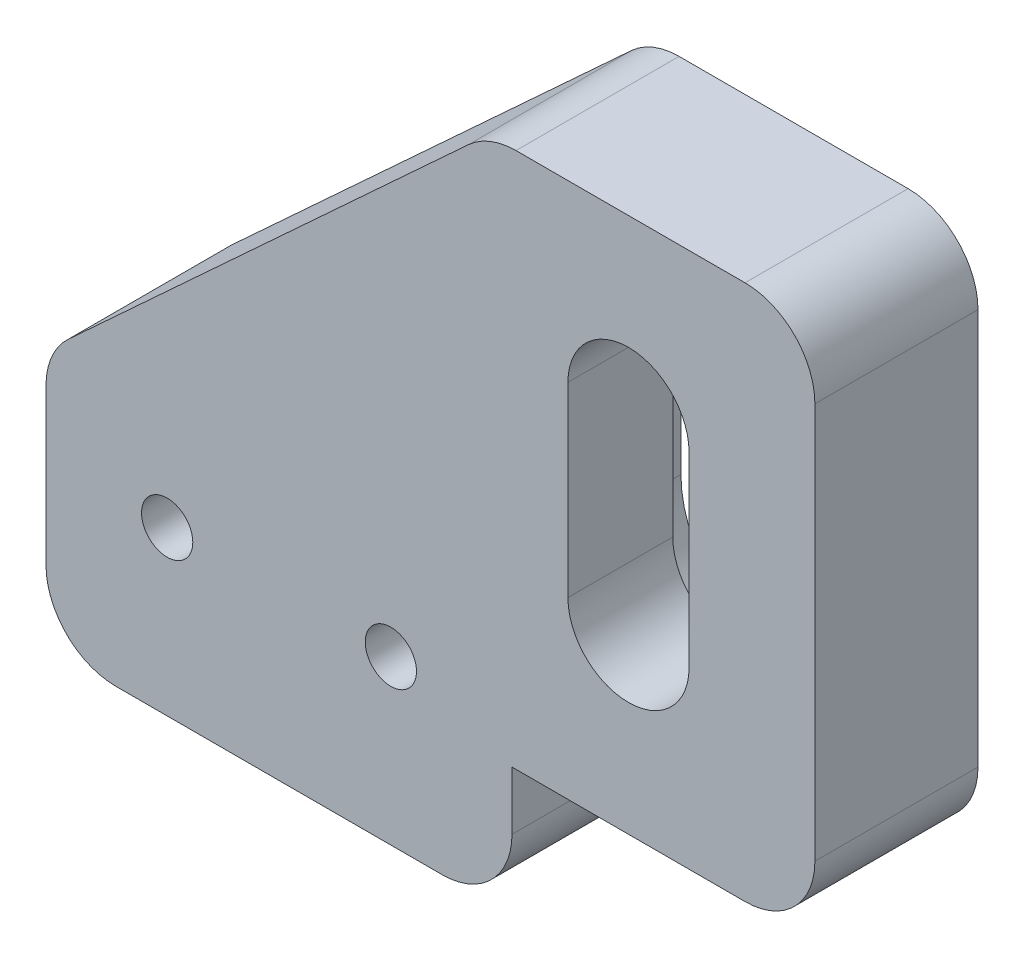
ISO-10303-21;
HEADER;
FILE_DESCRIPTION(('STEP AP214'),'2;1');
FILE_NAME('part.step','',(''),(''),'','','');
FILE_SCHEMA(('AUTOMOTIVE_DESIGN { 1 0 10303 214 1 1 1 1 }'));
ENDSEC;
DATA;
#1=APPLICATION_CONTEXT('core data for automotive mechanical design processes');
#2=APPLICATION_PROTOCOL_DEFINITION('international standard','automotive_design',2000,#1);
#3=PRODUCT_CONTEXT('',#1,'mechanical');
#4=PRODUCT('Part','Part','',(#3));
#5=PRODUCT_RELATED_PRODUCT_CATEGORY('part','',(#4));
#6=PRODUCT_DEFINITION_FORMATION('','',#4);
#7=PRODUCT_DEFINITION_CONTEXT('part definition',#1,'design');
#8=PRODUCT_DEFINITION('design','',#6,#7);
#9=PRODUCT_DEFINITION_SHAPE('','',#8);
#10=(LENGTH_UNIT() NAMED_UNIT(*) SI_UNIT(.MILLI.,.METRE.));
#11=(NAMED_UNIT(*) PLANE_ANGLE_UNIT() SI_UNIT($,.RADIAN.));
#12=(NAMED_UNIT(*) SI_UNIT($,.STERADIAN.) SOLID_ANGLE_UNIT());
#13=UNCERTAINTY_MEASURE_WITH_UNIT(LENGTH_MEASURE(1.E-05),#10,'distance_accuracy_value','');
#14=(GEOMETRIC_REPRESENTATION_CONTEXT(3) GLOBAL_UNCERTAINTY_ASSIGNED_CONTEXT((#13)) GLOBAL_UNIT_ASSIGNED_CONTEXT((#10,
#11,#12)) REPRESENTATION_CONTEXT('',''));
#15=CARTESIAN_POINT('',(0.,0.,0.));
#16=DIRECTION('',(0.,0.,1.));
#17=DIRECTION('',(1.,0.,0.));
#18=AXIS2_PLACEMENT_3D('',#15,#16,#17);
#19=CARTESIAN_POINT('',(25.,21.,7.));
#20=DIRECTION('',(0.,0.,-1.));
#21=DIRECTION('',(-1.,0.,0.));
#22=AXIS2_PLACEMENT_3D('',#19,#20,#21);
#23=CYLINDRICAL_SURFACE('',#22,2.6);
#24=DIRECTION('',(0.,0.,-1.));
#25=VECTOR('',#24,1.);
#26=CARTESIAN_POINT('',(22.4,21.,7.));
#27=LINE('',#26,#25);
#28=CARTESIAN_POINT('',(22.4,21.,7.));
#29=VERTEX_POINT('',#28);
#30=CARTESIAN_POINT('',(22.4,21.,2.5));
#31=VERTEX_POINT('',#30);
#32=EDGE_CURVE('E250',#29,#31,#27,.T.);
#33=ORIENTED_EDGE('',*,*,#32,.T.);
#34=CARTESIAN_POINT('',(25.,21.,2.5));
#35=DIRECTION('',(0.,0.,-1.));
#36=DIRECTION('',(-1.,0.,0.));
#37=AXIS2_PLACEMENT_3D('',#34,#35,#36);
#38=CIRCLE('',#37,2.6);
#39=CARTESIAN_POINT('',(27.6,21.,2.5));
#40=VERTEX_POINT('',#39);
#41=EDGE_CURVE('E217',#31,#40,#38,.T.);
#42=ORIENTED_EDGE('',*,*,#41,.T.);
#43=DIRECTION('',(0.,0.,-1.));
#44=VECTOR('',#43,1.);
#45=CARTESIAN_POINT('',(27.6,21.,7.));
#46=LINE('',#45,#44);
#47=CARTESIAN_POINT('',(27.6,21.,7.));
#48=VERTEX_POINT('',#47);
#49=EDGE_CURVE('E241',#48,#40,#46,.T.);
#50=ORIENTED_EDGE('',*,*,#49,.F.);
#51=CARTESIAN_POINT('',(25.,21.,7.));
#52=DIRECTION('',(0.,0.,1.));
#53=DIRECTION('',(1.,0.,0.));
#54=AXIS2_PLACEMENT_3D('',#51,#52,#53);
#55=CIRCLE('',#54,2.6);
#56=EDGE_CURVE('E230',#48,#29,#55,.T.);
#57=ORIENTED_EDGE('',*,*,#56,.T.);
#58=EDGE_LOOP('',(#33,#42,#50,#57));
#59=FACE_BOUND('',#58,.T.);
#60=ADVANCED_FACE('F33',(#59),#23,.F.);
#61=CARTESIAN_POINT('',(22.4,21.,7.));
#62=DIRECTION('',(1.,0.,0.));
#63=DIRECTION('',(0.,0.,-1.));
#64=AXIS2_PLACEMENT_3D('',#61,#62,#63);
#65=PLANE('',#64);
#66=DIRECTION('',(0.,0.,-1.));
#67=VECTOR('',#66,1.);
#68=CARTESIAN_POINT('',(22.4,13.,7.));
#69=LINE('',#68,#67);
#70=CARTESIAN_POINT('',(22.4,13.,7.));
#71=VERTEX_POINT('',#70);
#72=CARTESIAN_POINT('',(22.4,13.,2.5));
#73=VERTEX_POINT('',#72);
#74=EDGE_CURVE('E247',#71,#73,#69,.T.);
#75=ORIENTED_EDGE('',*,*,#74,.T.);
#76=DIRECTION('',(0.,1.,0.));
#77=VECTOR('',#76,1.);
#78=CARTESIAN_POINT('',(22.4,21.,2.5));
#79=LINE('',#78,#77);
#80=EDGE_CURVE('E214',#73,#31,#79,.T.);
#81=ORIENTED_EDGE('',*,*,#80,.T.);
#82=ORIENTED_EDGE('',*,*,#32,.F.);
#83=DIRECTION('',(0.,-1.,0.));
#84=VECTOR('',#83,1.);
#85=CARTESIAN_POINT('',(22.4,21.,7.));
#86=LINE('',#85,#84);
#87=EDGE_CURVE('E234',#29,#71,#86,.T.);
#88=ORIENTED_EDGE('',*,*,#87,.T.);
#89=EDGE_LOOP('',(#75,#81,#82,#88));
#90=FACE_BOUND('',#89,.T.);
#91=ADVANCED_FACE('F420',(#90),#65,.T.);
#92=CARTESIAN_POINT('',(25.,13.,7.));
#93=DIRECTION('',(0.,0.,-1.));
#94=DIRECTION('',(-1.,0.,0.));
#95=AXIS2_PLACEMENT_3D('',#92,#93,#94);
#96=CYLINDRICAL_SURFACE('',#95,2.6);
#97=DIRECTION('',(0.,0.,-1.));
#98=VECTOR('',#97,1.);
#99=CARTESIAN_POINT('',(27.6,13.,7.));
#100=LINE('',#99,#98);
#101=CARTESIAN_POINT('',(27.6,13.,7.));
#102=VERTEX_POINT('',#101);
#103=CARTESIAN_POINT('',(27.6,13.,2.5));
#104=VERTEX_POINT('',#103);
#105=EDGE_CURVE('E244',#102,#104,#100,.T.);
#106=ORIENTED_EDGE('',*,*,#105,.T.);
#107=CARTESIAN_POINT('',(25.,13.,2.5));
#108=DIRECTION('',(0.,0.,-1.));
#109=DIRECTION('',(-1.,0.,0.));
#110=AXIS2_PLACEMENT_3D('',#107,#108,#109);
#111=CIRCLE('',#110,2.6);
#112=EDGE_CURVE('E56',#104,#73,#111,.T.);
#113=ORIENTED_EDGE('',*,*,#112,.T.);
#114=ORIENTED_EDGE('',*,*,#74,.F.);
#115=CARTESIAN_POINT('',(25.,13.,7.));
#116=DIRECTION('',(0.,0.,1.));
#117=DIRECTION('',(1.,0.,0.));
#118=AXIS2_PLACEMENT_3D('',#115,#116,#117);
#119=CIRCLE('',#118,2.6);
#120=EDGE_CURVE('E236',#71,#102,#119,.T.);
#121=ORIENTED_EDGE('',*,*,#120,.T.);
#122=EDGE_LOOP('',(#106,#113,#114,#121));
#123=FACE_BOUND('',#122,.T.);
#124=ADVANCED_FACE('F426',(#123),#96,.F.);
#125=CARTESIAN_POINT('',(27.6,21.,7.));
#126=DIRECTION('',(-1.,0.,0.));
#127=DIRECTION('',(0.,0.,1.));
#128=AXIS2_PLACEMENT_3D('',#125,#126,#127);
#129=PLANE('',#128);
#130=ORIENTED_EDGE('',*,*,#49,.T.);
#131=DIRECTION('',(0.,-1.,0.));
#132=VECTOR('',#131,1.);
#133=CARTESIAN_POINT('',(27.6,21.,2.5));
#134=LINE('',#133,#132);
#135=EDGE_CURVE('E11',#40,#104,#134,.T.);
#136=ORIENTED_EDGE('',*,*,#135,.T.);
#137=ORIENTED_EDGE('',*,*,#105,.F.);
#138=DIRECTION('',(0.,1.,0.));
#139=VECTOR('',#138,1.);
#140=CARTESIAN_POINT('',(27.6,21.,7.));
#141=LINE('',#140,#139);
#142=EDGE_CURVE('E239',#102,#48,#141,.T.);
#143=ORIENTED_EDGE('',*,*,#142,.T.);
#144=EDGE_LOOP('',(#130,#136,#137,#143));
#145=FACE_BOUND('',#144,.T.);
#146=ADVANCED_FACE('F433',(#145),#129,.T.);
#147=CARTESIAN_POINT('',(30.,8.5,7.));
#148=DIRECTION('',(0.,0.,1.));
#149=DIRECTION('',(1.,0.,0.));
#150=AXIS2_PLACEMENT_3D('',#147,#148,#149);
#151=PLANE('',#150);
#152=CARTESIAN_POINT('',(5.2,7.,7.));
#153=DIRECTION('',(0.,0.,1.));
#154=DIRECTION('',(1.,0.,0.));
#155=AXIS2_PLACEMENT_3D('',#152,#153,#154);
#156=CIRCLE('',#155,1.1);
#157=CARTESIAN_POINT('',(6.3,7.,7.));
#158=VERTEX_POINT('',#157);
#159=EDGE_CURVE('E227',#158,#158,#156,.T.);
#160=ORIENTED_EDGE('',*,*,#159,.F.);
#161=EDGE_LOOP('',(#160));
#162=FACE_BOUND('',#161,.T.);
#163=CARTESIAN_POINT('',(30.,8.5,7.));
#164=DIRECTION('',(0.,0.,1.));
#165=DIRECTION('',(1.,0.,0.));
#166=AXIS2_PLACEMENT_3D('',#163,#164,#165);
#167=CIRCLE('',#166,3.);
#168=CARTESIAN_POINT('',(30.,5.5,7.));
#169=VERTEX_POINT('',#168);
#170=CARTESIAN_POINT('',(33.,8.5,7.));
#171=VERTEX_POINT('',#170);
#172=EDGE_CURVE('E254',#169,#171,#167,.T.);
#173=ORIENTED_EDGE('',*,*,#172,.T.);
#174=DIRECTION('',(0.,1.,0.));
#175=VECTOR('',#174,1.);
#176=CARTESIAN_POINT('',(33.,8.5,7.));
#177=LINE('',#176,#175);
#178=CARTESIAN_POINT('',(33.,25.5,7.));
#179=VERTEX_POINT('',#178);
#180=EDGE_CURVE('E257',#171,#179,#177,.T.);
#181=ORIENTED_EDGE('',*,*,#180,.T.);
#182=CARTESIAN_POINT('',(30.,25.5,7.));
#183=DIRECTION('',(0.,0.,1.));
#184=DIRECTION('',(1.,0.,0.));
#185=AXIS2_PLACEMENT_3D('',#182,#183,#184);
#186=CIRCLE('',#185,3.);
#187=CARTESIAN_POINT('',(30.,28.5,7.));
#188=VERTEX_POINT('',#187);
#189=EDGE_CURVE('E260',#179,#188,#186,.T.);
#190=ORIENTED_EDGE('',*,*,#189,.T.);
#191=DIRECTION('',(-1.,0.,0.));
#192=VECTOR('',#191,1.);
#193=CARTESIAN_POINT('',(20.1710598924878,28.5,7.));
#194=LINE('',#193,#192);
#195=CARTESIAN_POINT('',(20.1710598924878,28.5,7.));
#196=VERTEX_POINT('',#195);
#197=EDGE_CURVE('E262',#188,#196,#194,.T.);
#198=ORIENTED_EDGE('',*,*,#197,.T.);
#199=CARTESIAN_POINT('',(20.1710598924878,25.5,7.));
#200=DIRECTION('',(0.,0.,1.));
#201=DIRECTION('',(1.,0.,0.));
#202=AXIS2_PLACEMENT_3D('',#199,#200,#201);
#203=CIRCLE('',#202,3.);
#204=CARTESIAN_POINT('',(18.1386326282324,27.7066353154773,7.));
#205=VERTEX_POINT('',#204);
#206=EDGE_CURVE('E264',#196,#205,#203,.T.);
#207=ORIENTED_EDGE('',*,*,#206,.T.);
#208=DIRECTION('',(-0.735545105159087,-0.67747575475179,0.));
#209=VECTOR('',#208,1.);
#210=CARTESIAN_POINT('',(18.1386326282324,27.7066353154773,7.));
#211=LINE('',#210,#209);
#212=CARTESIAN_POINT('',(0.967572735744639,11.8911854145016,7.));
#213=VERTEX_POINT('',#212);
#214=EDGE_CURVE('E266',#205,#213,#211,.T.);
#215=ORIENTED_EDGE('',*,*,#214,.T.);
#216=CARTESIAN_POINT('',(3.,9.68455009902437,7.));
#217=DIRECTION('',(0.,0.,1.));
#218=DIRECTION('',(1.,0.,0.));
#219=AXIS2_PLACEMENT_3D('',#216,#217,#218);
#220=CIRCLE('',#219,3.);
#221=CARTESIAN_POINT('',(0.,9.68455009902436,7.));
#222=VERTEX_POINT('',#221);
#223=EDGE_CURVE('E268',#213,#222,#220,.T.);
#224=ORIENTED_EDGE('',*,*,#223,.T.);
#225=DIRECTION('',(0.,-1.,0.));
#226=VECTOR('',#225,1.);
#227=CARTESIAN_POINT('',(0.,9.68455009902436,7.));
#228=LINE('',#227,#226);
#229=CARTESIAN_POINT('',(0.,3.00000000000002,7.));
#230=VERTEX_POINT('',#229);
#231=EDGE_CURVE('E270',#222,#230,#228,.T.);
#232=ORIENTED_EDGE('',*,*,#231,.T.);
#233=CARTESIAN_POINT('',(3.,3.,7.));
#234=DIRECTION('',(0.,0.,1.));
#235=DIRECTION('',(1.,0.,0.));
#236=AXIS2_PLACEMENT_3D('',#233,#234,#235);
#237=CIRCLE('',#236,3.);
#238=CARTESIAN_POINT('',(3.00000000000002,0.,7.));
#239=VERTEX_POINT('',#238);
#240=EDGE_CURVE('E272',#230,#239,#237,.T.);
#241=ORIENTED_EDGE('',*,*,#240,.T.);
#242=DIRECTION('',(1.,0.,0.));
#243=VECTOR('',#242,1.);
#244=CARTESIAN_POINT('',(3.00000000000002,0.,7.));
#245=LINE('',#244,#243);
#246=CARTESIAN_POINT('',(17.,0.,7.));
#247=VERTEX_POINT('',#246);
#248=EDGE_CURVE('E274',#239,#247,#245,.T.);
#249=ORIENTED_EDGE('',*,*,#248,.T.);
#250=CARTESIAN_POINT('',(17.,3.,7.));
#251=DIRECTION('',(0.,0.,1.));
#252=DIRECTION('',(1.,0.,0.));
#253=AXIS2_PLACEMENT_3D('',#250,#251,#252);
#254=CIRCLE('',#253,3.);
#255=CARTESIAN_POINT('',(20.,3.00000000000002,7.));
#256=VERTEX_POINT('',#255);
#257=EDGE_CURVE('E276',#247,#256,#254,.T.);
#258=ORIENTED_EDGE('',*,*,#257,.T.);
#259=DIRECTION('',(0.,1.,0.));
#260=VECTOR('',#259,1.);
#261=CARTESIAN_POINT('',(20.,3.00000000000002,7.));
#262=LINE('',#261,#260);
#263=CARTESIAN_POINT('',(20.,5.5,7.));
#264=VERTEX_POINT('',#263);
#265=EDGE_CURVE('E278',#256,#264,#262,.T.);
#266=ORIENTED_EDGE('',*,*,#265,.T.);
#267=DIRECTION('',(1.,0.,0.));
#268=VECTOR('',#267,1.);
#269=CARTESIAN_POINT('',(20.,5.5,7.));
#270=LINE('',#269,#268);
#271=EDGE_CURVE('E280',#264,#169,#270,.T.);
#272=ORIENTED_EDGE('',*,*,#271,.T.);
#273=EDGE_LOOP('',(#173,#181,#190,#198,#207,#215,#224,#232,#241,#249,#258,#266,#272));
#274=FACE_BOUND('',#273,.T.);
#275=ORIENTED_EDGE('',*,*,#87,.F.);
#276=ORIENTED_EDGE('',*,*,#56,.F.);
#277=ORIENTED_EDGE('',*,*,#142,.F.);
#278=ORIENTED_EDGE('',*,*,#120,.F.);
#279=EDGE_LOOP('',(#275,#276,#277,#278));
#280=FACE_BOUND('',#279,.T.);
#281=CARTESIAN_POINT('',(14.8,7.,7.));
#282=DIRECTION('',(0.,0.,1.));
#283=DIRECTION('',(1.,0.,0.));
#284=AXIS2_PLACEMENT_3D('',#281,#282,#283);
#285=CIRCLE('',#284,1.1);
#286=CARTESIAN_POINT('',(15.9,7.,7.));
#287=VERTEX_POINT('',#286);
#288=EDGE_CURVE('E221',#287,#287,#285,.T.);
#289=ORIENTED_EDGE('',*,*,#288,.F.);
#290=EDGE_LOOP('',(#289));
#291=FACE_BOUND('',#290,.T.);
#292=ADVANCED_FACE('F369',(#162,#274,#280,#291),#151,.T.);
#293=CARTESIAN_POINT('',(30.,8.5,0.));
#294=DIRECTION('',(0.,0.,1.));
#295=DIRECTION('',(1.,0.,0.));
#296=AXIS2_PLACEMENT_3D('',#293,#294,#295);
#297=PLANE('',#296);
#298=DIRECTION('',(0.,-1.,0.));
#299=VECTOR('',#298,1.);
#300=CARTESIAN_POINT('',(29.75,21.,0.));
#301=LINE('',#300,#299);
#302=CARTESIAN_POINT('',(29.75,21.,0.));
#303=VERTEX_POINT('',#302);
#304=CARTESIAN_POINT('',(29.75,13.,0.));
#305=VERTEX_POINT('',#304);
#306=EDGE_CURVE('E204',#303,#305,#301,.T.);
#307=ORIENTED_EDGE('',*,*,#306,.F.);
#308=CARTESIAN_POINT('',(25.,21.,0.));
#309=DIRECTION('',(0.,0.,-1.));
#310=DIRECTION('',(-1.,0.,0.));
#311=AXIS2_PLACEMENT_3D('',#308,#309,#310);
#312=CIRCLE('',#311,4.75);
#313=CARTESIAN_POINT('',(20.25,21.,0.));
#314=VERTEX_POINT('',#313);
#315=EDGE_CURVE('E48',#314,#303,#312,.T.);
#316=ORIENTED_EDGE('',*,*,#315,.F.);
#317=DIRECTION('',(0.,1.,0.));
#318=VECTOR('',#317,1.);
#319=CARTESIAN_POINT('',(20.25,21.,0.));
#320=LINE('',#319,#318);
#321=CARTESIAN_POINT('',(20.25,13.,0.));
#322=VERTEX_POINT('',#321);
#323=EDGE_CURVE('E195',#322,#314,#320,.T.);
#324=ORIENTED_EDGE('',*,*,#323,.F.);
#325=CARTESIAN_POINT('',(25.,13.,0.));
#326=DIRECTION('',(0.,0.,-1.));
#327=DIRECTION('',(-1.,0.,0.));
#328=AXIS2_PLACEMENT_3D('',#325,#326,#327);
#329=CIRCLE('',#328,4.75);
#330=EDGE_CURVE('E198',#305,#322,#329,.T.);
#331=ORIENTED_EDGE('',*,*,#330,.F.);
#332=EDGE_LOOP('',(#307,#316,#324,#331));
#333=FACE_BOUND('',#332,.T.);
#334=CARTESIAN_POINT('',(5.2,7.,0.));
#335=DIRECTION('',(0.,0.,1.));
#336=DIRECTION('',(1.,0.,0.));
#337=AXIS2_PLACEMENT_3D('',#334,#335,#336);
#338=CIRCLE('',#337,1.1);
#339=CARTESIAN_POINT('',(6.3,7.,0.));
#340=VERTEX_POINT('',#339);
#341=EDGE_CURVE('E224',#340,#340,#338,.T.);
#342=ORIENTED_EDGE('',*,*,#341,.T.);
#343=EDGE_LOOP('',(#342));
#344=FACE_BOUND('',#343,.T.);
#345=CARTESIAN_POINT('',(30.,8.5,0.));
#346=DIRECTION('',(0.,0.,1.));
#347=DIRECTION('',(1.,0.,0.));
#348=AXIS2_PLACEMENT_3D('',#345,#346,#347);
#349=CIRCLE('',#348,3.);
#350=CARTESIAN_POINT('',(30.,5.5,0.));
#351=VERTEX_POINT('',#350);
#352=CARTESIAN_POINT('',(33.,8.5,0.));
#353=VERTEX_POINT('',#352);
#354=EDGE_CURVE('E253',#351,#353,#349,.T.);
#355=ORIENTED_EDGE('',*,*,#354,.F.);
#356=DIRECTION('',(1.,0.,0.));
#357=VECTOR('',#356,1.);
#358=CARTESIAN_POINT('',(20.,5.5,0.));
#359=LINE('',#358,#357);
#360=CARTESIAN_POINT('',(20.,5.5,0.));
#361=VERTEX_POINT('',#360);
#362=EDGE_CURVE('E258',#361,#351,#359,.T.);
#363=ORIENTED_EDGE('',*,*,#362,.F.);
#364=DIRECTION('',(0.,1.,0.));
#365=VECTOR('',#364,1.);
#366=CARTESIAN_POINT('',(20.,3.00000000000002,0.));
#367=LINE('',#366,#365);
#368=CARTESIAN_POINT('',(20.,3.00000000000002,0.));
#369=VERTEX_POINT('',#368);
#370=EDGE_CURVE('E305',#369,#361,#367,.T.);
#371=ORIENTED_EDGE('',*,*,#370,.F.);
#372=CARTESIAN_POINT('',(17.,3.,0.));
#373=DIRECTION('',(0.,0.,1.));
#374=DIRECTION('',(1.,0.,0.));
#375=AXIS2_PLACEMENT_3D('',#372,#373,#374);
#376=CIRCLE('',#375,3.);
#377=CARTESIAN_POINT('',(17.,0.,0.));
#378=VERTEX_POINT('',#377);
#379=EDGE_CURVE('E303',#378,#369,#376,.T.);
#380=ORIENTED_EDGE('',*,*,#379,.F.);
#381=DIRECTION('',(1.,0.,0.));
#382=VECTOR('',#381,1.);
#383=CARTESIAN_POINT('',(3.00000000000002,0.,0.));
#384=LINE('',#383,#382);
#385=CARTESIAN_POINT('',(3.00000000000002,0.,0.));
#386=VERTEX_POINT('',#385);
#387=EDGE_CURVE('E301',#386,#378,#384,.T.);
#388=ORIENTED_EDGE('',*,*,#387,.F.);
#389=CARTESIAN_POINT('',(3.,3.,0.));
#390=DIRECTION('',(0.,0.,1.));
#391=DIRECTION('',(1.,0.,0.));
#392=AXIS2_PLACEMENT_3D('',#389,#390,#391);
#393=CIRCLE('',#392,3.);
#394=CARTESIAN_POINT('',(0.,3.00000000000002,0.));
#395=VERTEX_POINT('',#394);
#396=EDGE_CURVE('E299',#395,#386,#393,.T.);
#397=ORIENTED_EDGE('',*,*,#396,.F.);
#398=DIRECTION('',(0.,-1.,0.));
#399=VECTOR('',#398,1.);
#400=CARTESIAN_POINT('',(0.,9.68455009902436,0.));
#401=LINE('',#400,#399);
#402=CARTESIAN_POINT('',(0.,9.68455009902436,0.));
#403=VERTEX_POINT('',#402);
#404=EDGE_CURVE('E297',#403,#395,#401,.T.);
#405=ORIENTED_EDGE('',*,*,#404,.F.);
#406=CARTESIAN_POINT('',(3.,9.68455009902437,0.));
#407=DIRECTION('',(0.,0.,1.));
#408=DIRECTION('',(1.,0.,0.));
#409=AXIS2_PLACEMENT_3D('',#406,#407,#408);
#410=CIRCLE('',#409,3.);
#411=CARTESIAN_POINT('',(0.967572735744639,11.8911854145016,0.));
#412=VERTEX_POINT('',#411);
#413=EDGE_CURVE('E295',#412,#403,#410,.T.);
#414=ORIENTED_EDGE('',*,*,#413,.F.);
#415=DIRECTION('',(-0.735545105159087,-0.67747575475179,0.));
#416=VECTOR('',#415,1.);
#417=CARTESIAN_POINT('',(18.1386326282324,27.7066353154773,0.));
#418=LINE('',#417,#416);
#419=CARTESIAN_POINT('',(18.1386326282324,27.7066353154773,0.));
#420=VERTEX_POINT('',#419);
#421=EDGE_CURVE('E293',#420,#412,#418,.T.);
#422=ORIENTED_EDGE('',*,*,#421,.F.);
#423=CARTESIAN_POINT('',(20.1710598924878,25.5,0.));
#424=DIRECTION('',(0.,0.,1.));
#425=DIRECTION('',(1.,0.,0.));
#426=AXIS2_PLACEMENT_3D('',#423,#424,#425);
#427=CIRCLE('',#426,3.);
#428=CARTESIAN_POINT('',(20.1710598924878,28.5,0.));
#429=VERTEX_POINT('',#428);
#430=EDGE_CURVE('E291',#429,#420,#427,.T.);
#431=ORIENTED_EDGE('',*,*,#430,.F.);
#432=DIRECTION('',(-1.,0.,0.));
#433=VECTOR('',#432,1.);
#434=CARTESIAN_POINT('',(20.1710598924878,28.5,0.));
#435=LINE('',#434,#433);
#436=CARTESIAN_POINT('',(30.,28.5,0.));
#437=VERTEX_POINT('',#436);
#438=EDGE_CURVE('E289',#437,#429,#435,.T.);
#439=ORIENTED_EDGE('',*,*,#438,.F.);
#440=CARTESIAN_POINT('',(30.,25.5,0.));
#441=DIRECTION('',(0.,0.,1.));
#442=DIRECTION('',(1.,0.,0.));
#443=AXIS2_PLACEMENT_3D('',#440,#441,#442);
#444=CIRCLE('',#443,3.);
#445=CARTESIAN_POINT('',(33.,25.5,0.));
#446=VERTEX_POINT('',#445);
#447=EDGE_CURVE('E287',#446,#437,#444,.T.);
#448=ORIENTED_EDGE('',*,*,#447,.F.);
#449=DIRECTION('',(0.,1.,0.));
#450=VECTOR('',#449,1.);
#451=CARTESIAN_POINT('',(33.,8.5,0.));
#452=LINE('',#451,#450);
#453=EDGE_CURVE('E285',#353,#446,#452,.T.);
#454=ORIENTED_EDGE('',*,*,#453,.F.);
#455=EDGE_LOOP('',(#355,#363,#371,#380,#388,#397,#405,#414,#422,#431,#439,#448,#454));
#456=FACE_BOUND('',#455,.T.);
#457=CARTESIAN_POINT('',(14.8,7.,0.));
#458=DIRECTION('',(0.,0.,1.));
#459=DIRECTION('',(1.,0.,0.));
#460=AXIS2_PLACEMENT_3D('',#457,#458,#459);
#461=CIRCLE('',#460,1.1);
#462=CARTESIAN_POINT('',(15.9,7.,0.));
#463=VERTEX_POINT('',#462);
#464=EDGE_CURVE('E220',#463,#463,#461,.T.);
#465=ORIENTED_EDGE('',*,*,#464,.T.);
#466=EDGE_LOOP('',(#465));
#467=FACE_BOUND('',#466,.T.);
#468=ADVANCED_FACE('F353',(#333,#344,#456,#467),#297,.F.);
#469=CARTESIAN_POINT('',(30.,8.5,7.));
#470=DIRECTION('',(0.,0.,-1.));
#471=DIRECTION('',(-1.,0.,0.));
#472=AXIS2_PLACEMENT_3D('',#469,#470,#471);
#473=CYLINDRICAL_SURFACE('',#472,3.);
#474=ORIENTED_EDGE('',*,*,#354,.T.);
#475=DIRECTION('',(0.,0.,-1.));
#476=VECTOR('',#475,1.);
#477=CARTESIAN_POINT('',(33.,8.5,7.));
#478=LINE('',#477,#476);
#479=EDGE_CURVE('E41',#171,#353,#478,.T.);
#480=ORIENTED_EDGE('',*,*,#479,.F.);
#481=ORIENTED_EDGE('',*,*,#172,.F.);
#482=DIRECTION('',(0.,0.,-1.));
#483=VECTOR('',#482,1.);
#484=CARTESIAN_POINT('',(30.,5.5,7.));
#485=LINE('',#484,#483);
#486=EDGE_CURVE('E282',#169,#351,#485,.T.);
#487=ORIENTED_EDGE('',*,*,#486,.T.);
#488=EDGE_LOOP('',(#474,#480,#481,#487));
#489=FACE_BOUND('',#488,.T.);
#490=ADVANCED_FACE('F35',(#489),#473,.T.);
#491=CARTESIAN_POINT('',(33.,8.5,7.));
#492=DIRECTION('',(-1.,0.,0.));
#493=DIRECTION('',(0.,0.,1.));
#494=AXIS2_PLACEMENT_3D('',#491,#492,#493);
#495=PLANE('',#494);
#496=ORIENTED_EDGE('',*,*,#453,.T.);
#497=DIRECTION('',(0.,0.,-1.));
#498=VECTOR('',#497,1.);
#499=CARTESIAN_POINT('',(33.,25.5,7.));
#500=LINE('',#499,#498);
#501=EDGE_CURVE('E340',#179,#446,#500,.T.);
#502=ORIENTED_EDGE('',*,*,#501,.F.);
#503=ORIENTED_EDGE('',*,*,#180,.F.);
#504=ORIENTED_EDGE('',*,*,#479,.T.);
#505=EDGE_LOOP('',(#496,#502,#503,#504));
#506=FACE_BOUND('',#505,.T.);
#507=ADVANCED_FACE('F345',(#506),#495,.F.);
#508=CARTESIAN_POINT('',(30.,25.5,7.));
#509=DIRECTION('',(0.,0.,-1.));
#510=DIRECTION('',(-1.,0.,0.));
#511=AXIS2_PLACEMENT_3D('',#508,#509,#510);
#512=CYLINDRICAL_SURFACE('',#511,3.);
#513=ORIENTED_EDGE('',*,*,#447,.T.);
#514=DIRECTION('',(0.,0.,-1.));
#515=VECTOR('',#514,1.);
#516=CARTESIAN_POINT('',(30.,28.5,7.));
#517=LINE('',#516,#515);
#518=EDGE_CURVE('E337',#188,#437,#517,.T.);
#519=ORIENTED_EDGE('',*,*,#518,.F.);
#520=ORIENTED_EDGE('',*,*,#189,.F.);
#521=ORIENTED_EDGE('',*,*,#501,.T.);
#522=EDGE_LOOP('',(#513,#519,#520,#521));
#523=FACE_BOUND('',#522,.T.);
#524=ADVANCED_FACE('F361',(#523),#512,.T.);
#525=CARTESIAN_POINT('',(20.1710598924878,28.5,7.));
#526=DIRECTION('',(0.,-1.,0.));
#527=DIRECTION('',(0.,0.,-1.));
#528=AXIS2_PLACEMENT_3D('',#525,#526,#527);
#529=PLANE('',#528);
#530=ORIENTED_EDGE('',*,*,#438,.T.);
#531=DIRECTION('',(0.,0.,-1.));
#532=VECTOR('',#531,1.);
#533=CARTESIAN_POINT('',(20.1710598924878,28.5,7.));
#534=LINE('',#533,#532);
#535=EDGE_CURVE('E334',#196,#429,#534,.T.);
#536=ORIENTED_EDGE('',*,*,#535,.F.);
#537=ORIENTED_EDGE('',*,*,#197,.F.);
#538=ORIENTED_EDGE('',*,*,#518,.T.);
#539=EDGE_LOOP('',(#530,#536,#537,#538));
#540=FACE_BOUND('',#539,.T.);
#541=ADVANCED_FACE('F365',(#540),#529,.F.);
#542=CARTESIAN_POINT('',(20.1710598924878,25.5,7.));
#543=DIRECTION('',(0.,0.,-1.));
#544=DIRECTION('',(-1.,0.,0.));
#545=AXIS2_PLACEMENT_3D('',#542,#543,#544);
#546=CYLINDRICAL_SURFACE('',#545,3.);
#547=ORIENTED_EDGE('',*,*,#430,.T.);
#548=DIRECTION('',(0.,0.,-1.));
#549=VECTOR('',#548,1.);
#550=CARTESIAN_POINT('',(18.1386326282324,27.7066353154773,7.));
#551=LINE('',#550,#549);
#552=EDGE_CURVE('E331',#205,#420,#551,.T.);
#553=ORIENTED_EDGE('',*,*,#552,.F.);
#554=ORIENTED_EDGE('',*,*,#206,.F.);
#555=ORIENTED_EDGE('',*,*,#535,.T.);
#556=EDGE_LOOP('',(#547,#553,#554,#555));
#557=FACE_BOUND('',#556,.T.);
#558=ADVANCED_FACE('F410',(#557),#546,.T.);
#559=CARTESIAN_POINT('',(18.1386326282324,27.7066353154773,7.));
#560=DIRECTION('',(0.67747575475179,-0.735545105159087,0.));
#561=DIRECTION('',(0.735545105159087,0.67747575475179,0.));
#562=AXIS2_PLACEMENT_3D('',#559,#560,#561);
#563=PLANE('',#562);
#564=ORIENTED_EDGE('',*,*,#421,.T.);
#565=DIRECTION('',(0.,0.,-1.));
#566=VECTOR('',#565,1.);
#567=CARTESIAN_POINT('',(0.967572735744639,11.8911854145016,7.));
#568=LINE('',#567,#566);
#569=EDGE_CURVE('E328',#213,#412,#568,.T.);
#570=ORIENTED_EDGE('',*,*,#569,.F.);
#571=ORIENTED_EDGE('',*,*,#214,.F.);
#572=ORIENTED_EDGE('',*,*,#552,.T.);
#573=EDGE_LOOP('',(#564,#570,#571,#572));
#574=FACE_BOUND('',#573,.T.);
#575=ADVANCED_FACE('F408',(#574),#563,.F.);
#576=CARTESIAN_POINT('',(3.,9.68455009902437,7.));
#577=DIRECTION('',(0.,0.,-1.));
#578=DIRECTION('',(-1.,0.,0.));
#579=AXIS2_PLACEMENT_3D('',#576,#577,#578);
#580=CYLINDRICAL_SURFACE('',#579,3.);
#581=ORIENTED_EDGE('',*,*,#413,.T.);
#582=DIRECTION('',(0.,0.,-1.));
#583=VECTOR('',#582,1.);
#584=CARTESIAN_POINT('',(0.,9.68455009902436,7.));
#585=LINE('',#584,#583);
#586=EDGE_CURVE('E325',#222,#403,#585,.T.);
#587=ORIENTED_EDGE('',*,*,#586,.F.);
#588=ORIENTED_EDGE('',*,*,#223,.F.);
#589=ORIENTED_EDGE('',*,*,#569,.T.);
#590=EDGE_LOOP('',(#581,#587,#588,#589));
#591=FACE_BOUND('',#590,.T.);
#592=ADVANCED_FACE('F404',(#591),#580,.T.);
#593=CARTESIAN_POINT('',(0.,9.68455009902436,7.));
#594=DIRECTION('',(1.,0.,0.));
#595=DIRECTION('',(0.,0.,-1.));
#596=AXIS2_PLACEMENT_3D('',#593,#594,#595);
#597=PLANE('',#596);
#598=ORIENTED_EDGE('',*,*,#404,.T.);
#599=DIRECTION('',(0.,0.,-1.));
#600=VECTOR('',#599,1.);
#601=CARTESIAN_POINT('',(0.,3.00000000000002,7.));
#602=LINE('',#601,#600);
#603=EDGE_CURVE('E322',#230,#395,#602,.T.);
#604=ORIENTED_EDGE('',*,*,#603,.F.);
#605=ORIENTED_EDGE('',*,*,#231,.F.);
#606=ORIENTED_EDGE('',*,*,#586,.T.);
#607=EDGE_LOOP('',(#598,#604,#605,#606));
#608=FACE_BOUND('',#607,.T.);
#609=ADVANCED_FACE('F399',(#608),#597,.F.);
#610=CARTESIAN_POINT('',(3.,3.,7.));
#611=DIRECTION('',(0.,0.,-1.));
#612=DIRECTION('',(-1.,0.,0.));
#613=AXIS2_PLACEMENT_3D('',#610,#611,#612);
#614=CYLINDRICAL_SURFACE('',#613,3.);
#615=ORIENTED_EDGE('',*,*,#396,.T.);
#616=DIRECTION('',(0.,0.,-1.));
#617=VECTOR('',#616,1.);
#618=CARTESIAN_POINT('',(3.00000000000002,0.,7.));
#619=LINE('',#618,#617);
#620=EDGE_CURVE('E319',#239,#386,#619,.T.);
#621=ORIENTED_EDGE('',*,*,#620,.F.);
#622=ORIENTED_EDGE('',*,*,#240,.F.);
#623=ORIENTED_EDGE('',*,*,#603,.T.);
#624=EDGE_LOOP('',(#615,#621,#622,#623));
#625=FACE_BOUND('',#624,.T.);
#626=ADVANCED_FACE('F393',(#625),#614,.T.);
#627=CARTESIAN_POINT('',(3.00000000000002,0.,7.));
#628=DIRECTION('',(0.,1.,0.));
#629=DIRECTION('',(0.,0.,1.));
#630=AXIS2_PLACEMENT_3D('',#627,#628,#629);
#631=PLANE('',#630);
#632=ORIENTED_EDGE('',*,*,#387,.T.);
#633=DIRECTION('',(0.,0.,-1.));
#634=VECTOR('',#633,1.);
#635=CARTESIAN_POINT('',(17.,0.,7.));
#636=LINE('',#635,#634);
#637=EDGE_CURVE('E316',#247,#378,#636,.T.);
#638=ORIENTED_EDGE('',*,*,#637,.F.);
#639=ORIENTED_EDGE('',*,*,#248,.F.);
#640=ORIENTED_EDGE('',*,*,#620,.T.);
#641=EDGE_LOOP('',(#632,#638,#639,#640));
#642=FACE_BOUND('',#641,.T.);
#643=ADVANCED_FACE('F389',(#642),#631,.F.);
#644=CARTESIAN_POINT('',(17.,3.,7.));
#645=DIRECTION('',(0.,0.,-1.));
#646=DIRECTION('',(-1.,0.,0.));
#647=AXIS2_PLACEMENT_3D('',#644,#645,#646);
#648=CYLINDRICAL_SURFACE('',#647,3.);
#649=ORIENTED_EDGE('',*,*,#379,.T.);
#650=DIRECTION('',(0.,0.,-1.));
#651=VECTOR('',#650,1.);
#652=CARTESIAN_POINT('',(20.,3.00000000000002,7.));
#653=LINE('',#652,#651);
#654=EDGE_CURVE('E313',#256,#369,#653,.T.);
#655=ORIENTED_EDGE('',*,*,#654,.F.);
#656=ORIENTED_EDGE('',*,*,#257,.F.);
#657=ORIENTED_EDGE('',*,*,#637,.T.);
#658=EDGE_LOOP('',(#649,#655,#656,#657));
#659=FACE_BOUND('',#658,.T.);
#660=ADVANCED_FACE('F384',(#659),#648,.T.);
#661=CARTESIAN_POINT('',(20.,3.00000000000002,7.));
#662=DIRECTION('',(-1.,0.,0.));
#663=DIRECTION('',(0.,0.,1.));
#664=AXIS2_PLACEMENT_3D('',#661,#662,#663);
#665=PLANE('',#664);
#666=ORIENTED_EDGE('',*,*,#370,.T.);
#667=DIRECTION('',(0.,0.,-1.));
#668=VECTOR('',#667,1.);
#669=CARTESIAN_POINT('',(20.,5.5,7.));
#670=LINE('',#669,#668);
#671=EDGE_CURVE('E310',#264,#361,#670,.T.);
#672=ORIENTED_EDGE('',*,*,#671,.F.);
#673=ORIENTED_EDGE('',*,*,#265,.F.);
#674=ORIENTED_EDGE('',*,*,#654,.T.);
#675=EDGE_LOOP('',(#666,#672,#673,#674));
#676=FACE_BOUND('',#675,.T.);
#677=ADVANCED_FACE('F378',(#676),#665,.F.);
#678=CARTESIAN_POINT('',(20.,5.5,7.));
#679=DIRECTION('',(0.,1.,0.));
#680=DIRECTION('',(-1.,0.,0.));
#681=AXIS2_PLACEMENT_3D('',#678,#679,#680);
#682=PLANE('',#681);
#683=ORIENTED_EDGE('',*,*,#362,.T.);
#684=ORIENTED_EDGE('',*,*,#486,.F.);
#685=ORIENTED_EDGE('',*,*,#271,.F.);
#686=ORIENTED_EDGE('',*,*,#671,.T.);
#687=EDGE_LOOP('',(#683,#684,#685,#686));
#688=FACE_BOUND('',#687,.T.);
#689=ADVANCED_FACE('F376',(#688),#682,.F.);
#690=CARTESIAN_POINT('',(5.2,7.,7.));
#691=DIRECTION('',(0.,0.,-1.));
#692=DIRECTION('',(-1.,0.,0.));
#693=AXIS2_PLACEMENT_3D('',#690,#691,#692);
#694=CYLINDRICAL_SURFACE('',#693,1.1);
#695=ORIENTED_EDGE('',*,*,#159,.T.);
#696=EDGE_LOOP('',(#695));
#697=FACE_BOUND('',#696,.T.);
#698=ORIENTED_EDGE('',*,*,#341,.F.);
#699=EDGE_LOOP('',(#698));
#700=FACE_BOUND('',#699,.T.);
#701=ADVANCED_FACE('F440',(#697,#700),#694,.F.);
#702=CARTESIAN_POINT('',(14.8,7.,7.));
#703=DIRECTION('',(0.,0.,-1.));
#704=DIRECTION('',(-1.,0.,0.));
#705=AXIS2_PLACEMENT_3D('',#702,#703,#704);
#706=CYLINDRICAL_SURFACE('',#705,1.1);
#707=ORIENTED_EDGE('',*,*,#288,.T.);
#708=EDGE_LOOP('',(#707));
#709=FACE_BOUND('',#708,.T.);
#710=ORIENTED_EDGE('',*,*,#464,.F.);
#711=EDGE_LOOP('',(#710));
#712=FACE_BOUND('',#711,.T.);
#713=ADVANCED_FACE('F486',(#709,#712),#706,.F.);
#714=CARTESIAN_POINT('',(25.,21.,2.5));
#715=DIRECTION('',(0.,0.,-1.));
#716=DIRECTION('',(-1.,0.,0.));
#717=AXIS2_PLACEMENT_3D('',#714,#715,#716);
#718=CYLINDRICAL_SURFACE('',#717,4.75);
#719=ORIENTED_EDGE('',*,*,#315,.T.);
#720=DIRECTION('',(0.,0.,-1.));
#721=VECTOR('',#720,1.);
#722=CARTESIAN_POINT('',(29.75,21.,2.5));
#723=LINE('',#722,#721);
#724=CARTESIAN_POINT('',(29.75,21.,2.5));
#725=VERTEX_POINT('',#724);
#726=EDGE_CURVE('E173',#725,#303,#723,.T.);
#727=ORIENTED_EDGE('',*,*,#726,.F.);
#728=CARTESIAN_POINT('',(25.,21.,2.5));
#729=DIRECTION('',(0.,0.,-1.));
#730=DIRECTION('',(-1.,0.,0.));
#731=AXIS2_PLACEMENT_3D('',#728,#729,#730);
#732=CIRCLE('',#731,4.75);
#733=CARTESIAN_POINT('',(20.25,21.,2.5));
#734=VERTEX_POINT('',#733);
#735=EDGE_CURVE('E177',#734,#725,#732,.T.);
#736=ORIENTED_EDGE('',*,*,#735,.F.);
#737=DIRECTION('',(0.,0.,-1.));
#738=VECTOR('',#737,1.);
#739=CARTESIAN_POINT('',(20.25,21.,2.5));
#740=LINE('',#739,#738);
#741=EDGE_CURVE('E208',#734,#314,#740,.T.);
#742=ORIENTED_EDGE('',*,*,#741,.T.);
#743=EDGE_LOOP('',(#719,#727,#736,#742));
#744=FACE_BOUND('',#743,.T.);
#745=ADVANCED_FACE('F175',(#744),#718,.F.);
#746=CARTESIAN_POINT('',(20.25,21.,2.5));
#747=DIRECTION('',(-1.,0.,0.));
#748=DIRECTION('',(0.,0.,1.));
#749=AXIS2_PLACEMENT_3D('',#746,#747,#748);
#750=PLANE('',#749);
#751=ORIENTED_EDGE('',*,*,#323,.T.);
#752=ORIENTED_EDGE('',*,*,#741,.F.);
#753=DIRECTION('',(0.,1.,0.));
#754=VECTOR('',#753,1.);
#755=CARTESIAN_POINT('',(20.25,21.,2.5));
#756=LINE('',#755,#754);
#757=CARTESIAN_POINT('',(20.25,13.,2.5));
#758=VERTEX_POINT('',#757);
#759=EDGE_CURVE('E183',#758,#734,#756,.T.);
#760=ORIENTED_EDGE('',*,*,#759,.F.);
#761=DIRECTION('',(0.,0.,-1.));
#762=VECTOR('',#761,1.);
#763=CARTESIAN_POINT('',(20.25,13.,2.5));
#764=LINE('',#763,#762);
#765=EDGE_CURVE('E210',#758,#322,#764,.T.);
#766=ORIENTED_EDGE('',*,*,#765,.T.);
#767=EDGE_LOOP('',(#751,#752,#760,#766));
#768=FACE_BOUND('',#767,.T.);
#769=ADVANCED_FACE('F501',(#768),#750,.F.);
#770=CARTESIAN_POINT('',(25.,13.,2.5));
#771=DIRECTION('',(0.,0.,-1.));
#772=DIRECTION('',(-1.,0.,0.));
#773=AXIS2_PLACEMENT_3D('',#770,#771,#772);
#774=CYLINDRICAL_SURFACE('',#773,4.75);
#775=ORIENTED_EDGE('',*,*,#330,.T.);
#776=ORIENTED_EDGE('',*,*,#765,.F.);
#777=CARTESIAN_POINT('',(25.,13.,2.5));
#778=DIRECTION('',(0.,0.,-1.));
#779=DIRECTION('',(-1.,0.,0.));
#780=AXIS2_PLACEMENT_3D('',#777,#778,#779);
#781=CIRCLE('',#780,4.75);
#782=CARTESIAN_POINT('',(29.75,13.,2.5));
#783=VERTEX_POINT('',#782);
#784=EDGE_CURVE('E191',#783,#758,#781,.T.);
#785=ORIENTED_EDGE('',*,*,#784,.F.);
#786=DIRECTION('',(0.,0.,-1.));
#787=VECTOR('',#786,1.);
#788=CARTESIAN_POINT('',(29.75,13.,2.5));
#789=LINE('',#788,#787);
#790=EDGE_CURVE('E182',#783,#305,#789,.T.);
#791=ORIENTED_EDGE('',*,*,#790,.T.);
#792=EDGE_LOOP('',(#775,#776,#785,#791));
#793=FACE_BOUND('',#792,.T.);
#794=ADVANCED_FACE('F509',(#793),#774,.F.);
#795=CARTESIAN_POINT('',(29.75,21.,2.5));
#796=DIRECTION('',(1.,0.,0.));
#797=DIRECTION('',(0.,0.,-1.));
#798=AXIS2_PLACEMENT_3D('',#795,#796,#797);
#799=PLANE('',#798);
#800=ORIENTED_EDGE('',*,*,#306,.T.);
#801=ORIENTED_EDGE('',*,*,#790,.F.);
#802=DIRECTION('',(0.,-1.,0.));
#803=VECTOR('',#802,1.);
#804=CARTESIAN_POINT('',(29.75,21.,2.5));
#805=LINE('',#804,#803);
#806=EDGE_CURVE('E186',#725,#783,#805,.T.);
#807=ORIENTED_EDGE('',*,*,#806,.F.);
#808=ORIENTED_EDGE('',*,*,#726,.T.);
#809=EDGE_LOOP('',(#800,#801,#807,#808));
#810=FACE_BOUND('',#809,.T.);
#811=ADVANCED_FACE('F187',(#810),#799,.F.);
#812=CARTESIAN_POINT('',(25.,21.,2.5));
#813=DIRECTION('',(0.,0.,-1.));
#814=DIRECTION('',(-1.,0.,0.));
#815=AXIS2_PLACEMENT_3D('',#812,#813,#814);
#816=PLANE('',#815);
#817=ORIENTED_EDGE('',*,*,#80,.F.);
#818=ORIENTED_EDGE('',*,*,#112,.F.);
#819=ORIENTED_EDGE('',*,*,#135,.F.);
#820=ORIENTED_EDGE('',*,*,#41,.F.);
#821=EDGE_LOOP('',(#817,#818,#819,#820));
#822=FACE_BOUND('',#821,.T.);
#823=ORIENTED_EDGE('',*,*,#735,.T.);
#824=ORIENTED_EDGE('',*,*,#806,.T.);
#825=ORIENTED_EDGE('',*,*,#784,.T.);
#826=ORIENTED_EDGE('',*,*,#759,.T.);
#827=EDGE_LOOP('',(#823,#824,#825,#826));
#828=FACE_BOUND('',#827,.T.);
#829=ADVANCED_FACE('F193',(#822,#828),#816,.T.);
#830=CLOSED_SHELL('',(#60,#91,#124,#146,#292,#468,#490,#507,#524,#541,#558,#575,#592,#609,#626,
#643,#660,#677,#689,#701,#713,#745,#769,#794,#811,#829));
#831=MANIFOLD_SOLID_BREP('B2',#830);
#832=ADVANCED_BREP_SHAPE_REPRESENTATION('',(#18,#831),#14);
#833=SHAPE_DEFINITION_REPRESENTATION(#9,#832);
ENDSEC;
END-ISO-10303-21;
